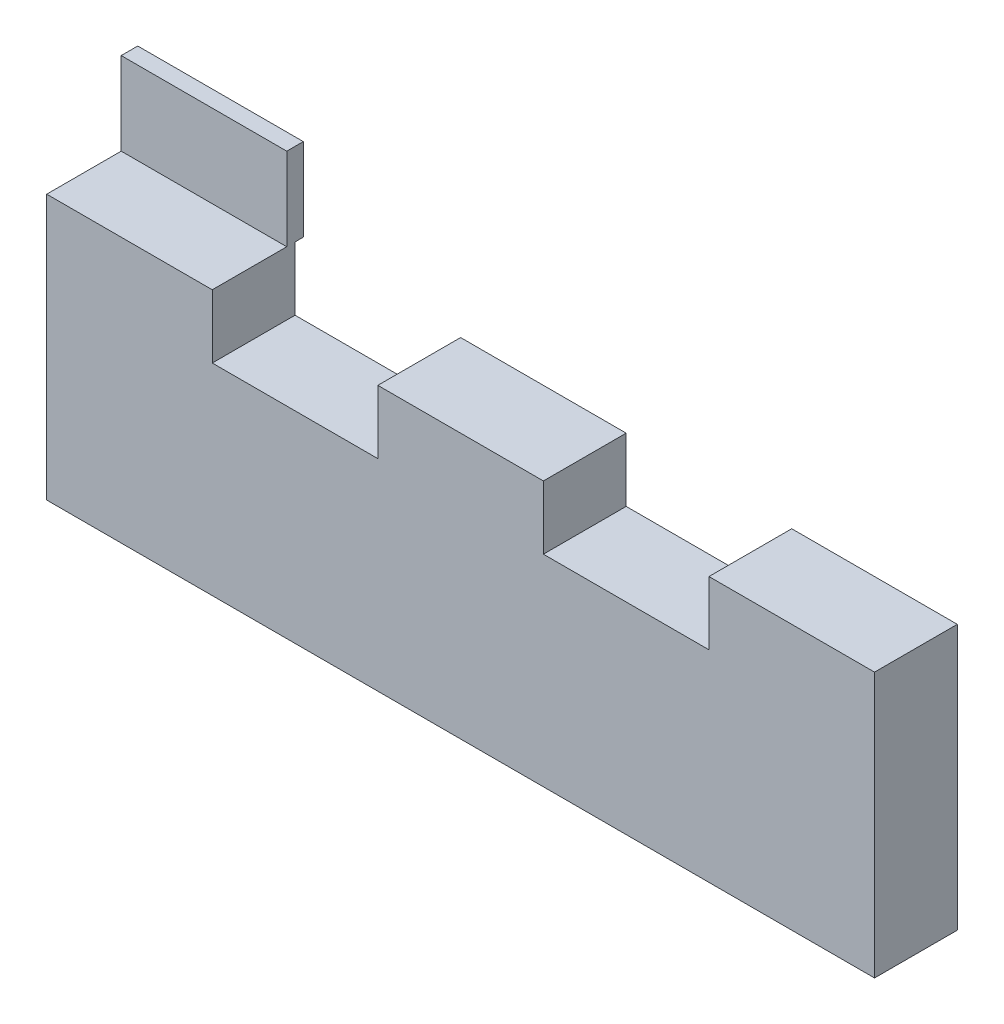
ISO-10303-21;
HEADER;
FILE_DESCRIPTION(('STEP AP214'),'2;1');
FILE_NAME('part.step','',(''),(''),'','','');
FILE_SCHEMA(('AUTOMOTIVE_DESIGN { 1 0 10303 214 1 1 1 1 }'));
ENDSEC;
DATA;
#1=APPLICATION_CONTEXT('core data for automotive mechanical design processes');
#2=APPLICATION_PROTOCOL_DEFINITION('international standard','automotive_design',2000,#1);
#3=PRODUCT_CONTEXT('',#1,'mechanical');
#4=PRODUCT('Part','Part','',(#3));
#5=PRODUCT_RELATED_PRODUCT_CATEGORY('part','',(#4));
#6=PRODUCT_DEFINITION_FORMATION('','',#4);
#7=PRODUCT_DEFINITION_CONTEXT('part definition',#1,'design');
#8=PRODUCT_DEFINITION('design','',#6,#7);
#9=PRODUCT_DEFINITION_SHAPE('','',#8);
#10=(LENGTH_UNIT() NAMED_UNIT(*) SI_UNIT(.MILLI.,.METRE.));
#11=(NAMED_UNIT(*) PLANE_ANGLE_UNIT() SI_UNIT($,.RADIAN.));
#12=(NAMED_UNIT(*) SI_UNIT($,.STERADIAN.) SOLID_ANGLE_UNIT());
#13=UNCERTAINTY_MEASURE_WITH_UNIT(LENGTH_MEASURE(1.E-05),#10,'distance_accuracy_value','');
#14=(GEOMETRIC_REPRESENTATION_CONTEXT(3) GLOBAL_UNCERTAINTY_ASSIGNED_CONTEXT((#13)) GLOBAL_UNIT_ASSIGNED_CONTEXT((#10,
#11,#12)) REPRESENTATION_CONTEXT('',''));
#15=CARTESIAN_POINT('',(0.,0.,0.));
#16=DIRECTION('',(0.,0.,1.));
#17=DIRECTION('',(1.,0.,0.));
#18=AXIS2_PLACEMENT_3D('',#15,#16,#17);
#19=CARTESIAN_POINT('',(0.,32.,10.));
#20=DIRECTION('',(0.,-1.,0.));
#21=DIRECTION('',(0.,0.,-1.));
#22=AXIS2_PLACEMENT_3D('',#19,#20,#21);
#23=PLANE('',#22);
#24=DIRECTION('',(1.,0.,0.));
#25=VECTOR('',#24,1.);
#26=CARTESIAN_POINT('',(0.,32.,1.));
#27=LINE('',#26,#25);
#28=CARTESIAN_POINT('',(0.,32.,1.));
#29=VERTEX_POINT('',#28);
#30=CARTESIAN_POINT('',(20.,32.,1.));
#31=VERTEX_POINT('',#30);
#32=EDGE_CURVE('E52',#29,#31,#27,.T.);
#33=ORIENTED_EDGE('',*,*,#32,.F.);
#34=DIRECTION('',(0.,0.,-1.));
#35=VECTOR('',#34,1.);
#36=CARTESIAN_POINT('',(0.,32.,10.));
#37=LINE('',#36,#35);
#38=CARTESIAN_POINT('',(0.,32.,10.));
#39=VERTEX_POINT('',#38);
#40=EDGE_CURVE('E169',#39,#29,#37,.T.);
#41=ORIENTED_EDGE('',*,*,#40,.F.);
#42=DIRECTION('',(-1.,0.,0.));
#43=VECTOR('',#42,1.);
#44=CARTESIAN_POINT('',(0.,32.,10.));
#45=LINE('',#44,#43);
#46=CARTESIAN_POINT('',(20.,32.,10.));
#47=VERTEX_POINT('',#46);
#48=EDGE_CURVE('E201',#47,#39,#45,.T.);
#49=ORIENTED_EDGE('',*,*,#48,.F.);
#50=DIRECTION('',(0.,0.,-1.));
#51=VECTOR('',#50,1.);
#52=CARTESIAN_POINT('',(20.,32.,10.));
#53=LINE('',#52,#51);
#54=EDGE_CURVE('E48',#47,#31,#53,.T.);
#55=ORIENTED_EDGE('',*,*,#54,.T.);
#56=EDGE_LOOP('',(#33,#41,#49,#55));
#57=FACE_BOUND('',#56,.T.);
#58=ADVANCED_FACE('F33',(#57),#23,.F.);
#59=CARTESIAN_POINT('',(100.,0.,10.));
#60=DIRECTION('',(0.,1.,0.));
#61=DIRECTION('',(-1.,0.,0.));
#62=AXIS2_PLACEMENT_3D('',#59,#60,#61);
#63=PLANE('',#62);
#64=DIRECTION('',(1.,0.,0.));
#65=VECTOR('',#64,1.);
#66=CARTESIAN_POINT('',(100.,0.,0.));
#67=LINE('',#66,#65);
#68=CARTESIAN_POINT('',(0.,0.,0.));
#69=VERTEX_POINT('',#68);
#70=CARTESIAN_POINT('',(100.,0.,0.));
#71=VERTEX_POINT('',#70);
#72=EDGE_CURVE('E170',#69,#71,#67,.T.);
#73=ORIENTED_EDGE('',*,*,#72,.T.);
#74=DIRECTION('',(0.,0.,-1.));
#75=VECTOR('',#74,1.);
#76=CARTESIAN_POINT('',(100.,0.,10.));
#77=LINE('',#76,#75);
#78=CARTESIAN_POINT('',(100.,0.,10.));
#79=VERTEX_POINT('',#78);
#80=EDGE_CURVE('E11',#79,#71,#77,.T.);
#81=ORIENTED_EDGE('',*,*,#80,.F.);
#82=DIRECTION('',(1.,0.,0.));
#83=VECTOR('',#82,1.);
#84=CARTESIAN_POINT('',(100.,0.,10.));
#85=LINE('',#84,#83);
#86=CARTESIAN_POINT('',(0.,0.,10.));
#87=VERTEX_POINT('',#86);
#88=EDGE_CURVE('E179',#87,#79,#85,.T.);
#89=ORIENTED_EDGE('',*,*,#88,.F.);
#90=DIRECTION('',(0.,0.,-1.));
#91=VECTOR('',#90,1.);
#92=CARTESIAN_POINT('',(0.,0.,10.));
#93=LINE('',#92,#91);
#94=EDGE_CURVE('E204',#87,#69,#93,.T.);
#95=ORIENTED_EDGE('',*,*,#94,.T.);
#96=EDGE_LOOP('',(#73,#81,#89,#95));
#97=FACE_BOUND('',#96,.T.);
#98=ADVANCED_FACE('F35',(#97),#63,.F.);
#99=CARTESIAN_POINT('',(100.,32.,10.));
#100=DIRECTION('',(-1.,0.,0.));
#101=DIRECTION('',(0.,0.,1.));
#102=AXIS2_PLACEMENT_3D('',#99,#100,#101);
#103=PLANE('',#102);
#104=DIRECTION('',(0.,1.,0.));
#105=VECTOR('',#104,1.);
#106=CARTESIAN_POINT('',(100.,32.,0.));
#107=LINE('',#106,#105);
#108=CARTESIAN_POINT('',(100.,32.,0.));
#109=VERTEX_POINT('',#108);
#110=EDGE_CURVE('E173',#71,#109,#107,.T.);
#111=ORIENTED_EDGE('',*,*,#110,.T.);
#112=DIRECTION('',(0.,0.,-1.));
#113=VECTOR('',#112,1.);
#114=CARTESIAN_POINT('',(100.,32.,10.));
#115=LINE('',#114,#113);
#116=CARTESIAN_POINT('',(100.,32.,10.));
#117=VERTEX_POINT('',#116);
#118=EDGE_CURVE('E41',#117,#109,#115,.T.);
#119=ORIENTED_EDGE('',*,*,#118,.F.);
#120=DIRECTION('',(0.,1.,0.));
#121=VECTOR('',#120,1.);
#122=CARTESIAN_POINT('',(100.,32.,10.));
#123=LINE('',#122,#121);
#124=EDGE_CURVE('E182',#79,#117,#123,.T.);
#125=ORIENTED_EDGE('',*,*,#124,.F.);
#126=ORIENTED_EDGE('',*,*,#80,.T.);
#127=EDGE_LOOP('',(#111,#119,#125,#126));
#128=FACE_BOUND('',#127,.T.);
#129=ADVANCED_FACE('F279',(#128),#103,.F.);
#130=CARTESIAN_POINT('',(80.,32.,10.));
#131=DIRECTION('',(0.,-1.,0.));
#132=DIRECTION('',(1.,0.,0.));
#133=AXIS2_PLACEMENT_3D('',#130,#131,#132);
#134=PLANE('',#133);
#135=DIRECTION('',(-1.,0.,0.));
#136=VECTOR('',#135,1.);
#137=CARTESIAN_POINT('',(80.,32.,0.));
#138=LINE('',#137,#136);
#139=CARTESIAN_POINT('',(80.,32.,0.));
#140=VERTEX_POINT('',#139);
#141=EDGE_CURVE('E207',#109,#140,#138,.T.);
#142=ORIENTED_EDGE('',*,*,#141,.T.);
#143=DIRECTION('',(0.,0.,-1.));
#144=VECTOR('',#143,1.);
#145=CARTESIAN_POINT('',(80.,32.,10.));
#146=LINE('',#145,#144);
#147=CARTESIAN_POINT('',(80.,32.,10.));
#148=VERTEX_POINT('',#147);
#149=EDGE_CURVE('E249',#148,#140,#146,.T.);
#150=ORIENTED_EDGE('',*,*,#149,.F.);
#151=DIRECTION('',(-1.,0.,0.));
#152=VECTOR('',#151,1.);
#153=CARTESIAN_POINT('',(80.,32.,10.));
#154=LINE('',#153,#152);
#155=EDGE_CURVE('E185',#117,#148,#154,.T.);
#156=ORIENTED_EDGE('',*,*,#155,.F.);
#157=ORIENTED_EDGE('',*,*,#118,.T.);
#158=EDGE_LOOP('',(#142,#150,#156,#157));
#159=FACE_BOUND('',#158,.T.);
#160=ADVANCED_FACE('F256',(#159),#134,.F.);
#161=CARTESIAN_POINT('',(80.,24.3353293413174,10.));
#162=DIRECTION('',(1.,0.,0.));
#163=DIRECTION('',(0.,0.,-1.));
#164=AXIS2_PLACEMENT_3D('',#161,#162,#163);
#165=PLANE('',#164);
#166=DIRECTION('',(0.,-1.,0.));
#167=VECTOR('',#166,1.);
#168=CARTESIAN_POINT('',(80.,24.3353293413174,0.));
#169=LINE('',#168,#167);
#170=CARTESIAN_POINT('',(80.,24.3353293413174,0.));
#171=VERTEX_POINT('',#170);
#172=EDGE_CURVE('E209',#140,#171,#169,.T.);
#173=ORIENTED_EDGE('',*,*,#172,.T.);
#174=DIRECTION('',(0.,0.,-1.));
#175=VECTOR('',#174,1.);
#176=CARTESIAN_POINT('',(80.,24.3353293413174,10.));
#177=LINE('',#176,#175);
#178=CARTESIAN_POINT('',(80.,24.3353293413174,10.));
#179=VERTEX_POINT('',#178);
#180=EDGE_CURVE('E246',#179,#171,#177,.T.);
#181=ORIENTED_EDGE('',*,*,#180,.F.);
#182=DIRECTION('',(0.,-1.,0.));
#183=VECTOR('',#182,1.);
#184=CARTESIAN_POINT('',(80.,24.3353293413174,10.));
#185=LINE('',#184,#183);
#186=EDGE_CURVE('E187',#148,#179,#185,.T.);
#187=ORIENTED_EDGE('',*,*,#186,.F.);
#188=ORIENTED_EDGE('',*,*,#149,.T.);
#189=EDGE_LOOP('',(#173,#181,#187,#188));
#190=FACE_BOUND('',#189,.T.);
#191=ADVANCED_FACE('F267',(#190),#165,.F.);
#192=CARTESIAN_POINT('',(60.,24.3353293413174,10.));
#193=DIRECTION('',(0.,-1.,0.));
#194=DIRECTION('',(0.,0.,-1.));
#195=AXIS2_PLACEMENT_3D('',#192,#193,#194);
#196=PLANE('',#195);
#197=DIRECTION('',(-1.,0.,0.));
#198=VECTOR('',#197,1.);
#199=CARTESIAN_POINT('',(60.,24.3353293413174,0.));
#200=LINE('',#199,#198);
#201=CARTESIAN_POINT('',(60.,24.3353293413174,0.));
#202=VERTEX_POINT('',#201);
#203=EDGE_CURVE('E211',#171,#202,#200,.T.);
#204=ORIENTED_EDGE('',*,*,#203,.T.);
#205=DIRECTION('',(0.,0.,-1.));
#206=VECTOR('',#205,1.);
#207=CARTESIAN_POINT('',(60.,24.3353293413174,10.));
#208=LINE('',#207,#206);
#209=CARTESIAN_POINT('',(60.,24.3353293413174,10.));
#210=VERTEX_POINT('',#209);
#211=EDGE_CURVE('E243',#210,#202,#208,.T.);
#212=ORIENTED_EDGE('',*,*,#211,.F.);
#213=DIRECTION('',(-1.,0.,0.));
#214=VECTOR('',#213,1.);
#215=CARTESIAN_POINT('',(60.,24.3353293413174,10.));
#216=LINE('',#215,#214);
#217=EDGE_CURVE('E189',#179,#210,#216,.T.);
#218=ORIENTED_EDGE('',*,*,#217,.F.);
#219=ORIENTED_EDGE('',*,*,#180,.T.);
#220=EDGE_LOOP('',(#204,#212,#218,#219));
#221=FACE_BOUND('',#220,.T.);
#222=ADVANCED_FACE('F271',(#221),#196,.F.);
#223=CARTESIAN_POINT('',(60.,32.,10.));
#224=DIRECTION('',(-1.,0.,0.));
#225=DIRECTION('',(0.,-1.,0.));
#226=AXIS2_PLACEMENT_3D('',#223,#224,#225);
#227=PLANE('',#226);
#228=DIRECTION('',(0.,1.,0.));
#229=VECTOR('',#228,1.);
#230=CARTESIAN_POINT('',(60.,32.,0.));
#231=LINE('',#230,#229);
#232=CARTESIAN_POINT('',(60.,32.,0.));
#233=VERTEX_POINT('',#232);
#234=EDGE_CURVE('E213',#202,#233,#231,.T.);
#235=ORIENTED_EDGE('',*,*,#234,.T.);
#236=DIRECTION('',(0.,0.,-1.));
#237=VECTOR('',#236,1.);
#238=CARTESIAN_POINT('',(60.,32.,10.));
#239=LINE('',#238,#237);
#240=CARTESIAN_POINT('',(60.,32.,10.));
#241=VERTEX_POINT('',#240);
#242=EDGE_CURVE('E240',#241,#233,#239,.T.);
#243=ORIENTED_EDGE('',*,*,#242,.F.);
#244=DIRECTION('',(0.,1.,0.));
#245=VECTOR('',#244,1.);
#246=CARTESIAN_POINT('',(60.,32.,10.));
#247=LINE('',#246,#245);
#248=EDGE_CURVE('E191',#210,#241,#247,.T.);
#249=ORIENTED_EDGE('',*,*,#248,.F.);
#250=ORIENTED_EDGE('',*,*,#211,.T.);
#251=EDGE_LOOP('',(#235,#243,#249,#250));
#252=FACE_BOUND('',#251,.T.);
#253=ADVANCED_FACE('F323',(#252),#227,.F.);
#254=CARTESIAN_POINT('',(40.,32.,10.));
#255=DIRECTION('',(0.,-1.,0.));
#256=DIRECTION('',(0.,0.,-1.));
#257=AXIS2_PLACEMENT_3D('',#254,#255,#256);
#258=PLANE('',#257);
#259=DIRECTION('',(-1.,0.,0.));
#260=VECTOR('',#259,1.);
#261=CARTESIAN_POINT('',(40.,32.,0.));
#262=LINE('',#261,#260);
#263=CARTESIAN_POINT('',(40.,32.,0.));
#264=VERTEX_POINT('',#263);
#265=EDGE_CURVE('E215',#233,#264,#262,.T.);
#266=ORIENTED_EDGE('',*,*,#265,.T.);
#267=DIRECTION('',(0.,0.,-1.));
#268=VECTOR('',#267,1.);
#269=CARTESIAN_POINT('',(40.,32.,10.));
#270=LINE('',#269,#268);
#271=CARTESIAN_POINT('',(40.,32.,10.));
#272=VERTEX_POINT('',#271);
#273=EDGE_CURVE('E237',#272,#264,#270,.T.);
#274=ORIENTED_EDGE('',*,*,#273,.F.);
#275=DIRECTION('',(-1.,0.,0.));
#276=VECTOR('',#275,1.);
#277=CARTESIAN_POINT('',(40.,32.,10.));
#278=LINE('',#277,#276);
#279=EDGE_CURVE('E193',#241,#272,#278,.T.);
#280=ORIENTED_EDGE('',*,*,#279,.F.);
#281=ORIENTED_EDGE('',*,*,#242,.T.);
#282=EDGE_LOOP('',(#266,#274,#280,#281));
#283=FACE_BOUND('',#282,.T.);
#284=ADVANCED_FACE('F321',(#283),#258,.F.);
#285=CARTESIAN_POINT('',(40.,24.3353293413174,10.));
#286=DIRECTION('',(1.,0.,0.));
#287=DIRECTION('',(0.,0.,-1.));
#288=AXIS2_PLACEMENT_3D('',#285,#286,#287);
#289=PLANE('',#288);
#290=DIRECTION('',(0.,-1.,0.));
#291=VECTOR('',#290,1.);
#292=CARTESIAN_POINT('',(40.,24.3353293413174,0.));
#293=LINE('',#292,#291);
#294=CARTESIAN_POINT('',(40.,24.3353293413174,0.));
#295=VERTEX_POINT('',#294);
#296=EDGE_CURVE('E217',#264,#295,#293,.T.);
#297=ORIENTED_EDGE('',*,*,#296,.T.);
#298=DIRECTION('',(0.,0.,-1.));
#299=VECTOR('',#298,1.);
#300=CARTESIAN_POINT('',(40.,24.3353293413174,10.));
#301=LINE('',#300,#299);
#302=CARTESIAN_POINT('',(40.,24.3353293413174,10.));
#303=VERTEX_POINT('',#302);
#304=EDGE_CURVE('E234',#303,#295,#301,.T.);
#305=ORIENTED_EDGE('',*,*,#304,.F.);
#306=DIRECTION('',(0.,-1.,0.));
#307=VECTOR('',#306,1.);
#308=CARTESIAN_POINT('',(40.,24.3353293413174,10.));
#309=LINE('',#308,#307);
#310=EDGE_CURVE('E195',#272,#303,#309,.T.);
#311=ORIENTED_EDGE('',*,*,#310,.F.);
#312=ORIENTED_EDGE('',*,*,#273,.T.);
#313=EDGE_LOOP('',(#297,#305,#311,#312));
#314=FACE_BOUND('',#313,.T.);
#315=ADVANCED_FACE('F317',(#314),#289,.F.);
#316=CARTESIAN_POINT('',(20.,24.3353293413174,10.));
#317=DIRECTION('',(0.,-1.,0.));
#318=DIRECTION('',(0.,0.,-1.));
#319=AXIS2_PLACEMENT_3D('',#316,#317,#318);
#320=PLANE('',#319);
#321=DIRECTION('',(-1.,0.,0.));
#322=VECTOR('',#321,1.);
#323=CARTESIAN_POINT('',(20.,24.3353293413174,0.));
#324=LINE('',#323,#322);
#325=CARTESIAN_POINT('',(20.,24.3353293413174,0.));
#326=VERTEX_POINT('',#325);
#327=EDGE_CURVE('E219',#295,#326,#324,.T.);
#328=ORIENTED_EDGE('',*,*,#327,.T.);
#329=DIRECTION('',(0.,0.,-1.));
#330=VECTOR('',#329,1.);
#331=CARTESIAN_POINT('',(20.,24.3353293413174,10.));
#332=LINE('',#331,#330);
#333=CARTESIAN_POINT('',(20.,24.3353293413174,10.));
#334=VERTEX_POINT('',#333);
#335=EDGE_CURVE('E231',#334,#326,#332,.T.);
#336=ORIENTED_EDGE('',*,*,#335,.F.);
#337=DIRECTION('',(-1.,0.,0.));
#338=VECTOR('',#337,1.);
#339=CARTESIAN_POINT('',(20.,24.3353293413174,10.));
#340=LINE('',#339,#338);
#341=EDGE_CURVE('E197',#303,#334,#340,.T.);
#342=ORIENTED_EDGE('',*,*,#341,.F.);
#343=ORIENTED_EDGE('',*,*,#304,.T.);
#344=EDGE_LOOP('',(#328,#336,#342,#343));
#345=FACE_BOUND('',#344,.T.);
#346=ADVANCED_FACE('F312',(#345),#320,.F.);
#347=CARTESIAN_POINT('',(20.,32.,10.));
#348=DIRECTION('',(-1.,0.,0.));
#349=DIRECTION('',(0.,0.,1.));
#350=AXIS2_PLACEMENT_3D('',#347,#348,#349);
#351=PLANE('',#350);
#352=DIRECTION('',(0.,1.,0.));
#353=VECTOR('',#352,1.);
#354=CARTESIAN_POINT('',(20.,32.,0.));
#355=LINE('',#354,#353);
#356=CARTESIAN_POINT('',(20.,32.,0.));
#357=VERTEX_POINT('',#356);
#358=EDGE_CURVE('E221',#326,#357,#355,.T.);
#359=ORIENTED_EDGE('',*,*,#358,.T.);
#360=DIRECTION('',(0.,0.,-1.));
#361=VECTOR('',#360,1.);
#362=CARTESIAN_POINT('',(20.,32.,1.));
#363=LINE('',#362,#361);
#364=CARTESIAN_POINT('',(20.,32.,-1.));
#365=VERTEX_POINT('',#364);
#366=EDGE_CURVE('E291',#357,#365,#363,.T.);
#367=ORIENTED_EDGE('',*,*,#366,.T.);
#368=DIRECTION('',(0.,-1.,0.));
#369=VECTOR('',#368,1.);
#370=CARTESIAN_POINT('',(20.,42.,-1.));
#371=LINE('',#370,#369);
#372=CARTESIAN_POINT('',(20.,42.,-1.));
#373=VERTEX_POINT('',#372);
#374=EDGE_CURVE('E175',#373,#365,#371,.T.);
#375=ORIENTED_EDGE('',*,*,#374,.F.);
#376=DIRECTION('',(0.,0.,-1.));
#377=VECTOR('',#376,1.);
#378=CARTESIAN_POINT('',(20.,42.,1.));
#379=LINE('',#378,#377);
#380=CARTESIAN_POINT('',(20.,42.,1.));
#381=VERTEX_POINT('',#380);
#382=EDGE_CURVE('E155',#381,#373,#379,.T.);
#383=ORIENTED_EDGE('',*,*,#382,.F.);
#384=DIRECTION('',(0.,-1.,0.));
#385=VECTOR('',#384,1.);
#386=CARTESIAN_POINT('',(20.,42.,1.));
#387=LINE('',#386,#385);
#388=EDGE_CURVE('E152',#381,#31,#387,.T.);
#389=ORIENTED_EDGE('',*,*,#388,.T.);
#390=ORIENTED_EDGE('',*,*,#54,.F.);
#391=DIRECTION('',(0.,1.,0.));
#392=VECTOR('',#391,1.);
#393=CARTESIAN_POINT('',(20.,32.,10.));
#394=LINE('',#393,#392);
#395=EDGE_CURVE('E199',#334,#47,#394,.T.);
#396=ORIENTED_EDGE('',*,*,#395,.F.);
#397=ORIENTED_EDGE('',*,*,#335,.T.);
#398=EDGE_LOOP('',(#359,#367,#375,#383,#389,#390,#396,#397));
#399=FACE_BOUND('',#398,.T.);
#400=ADVANCED_FACE('F305',(#399),#351,.F.);
#401=CARTESIAN_POINT('',(0.,0.,10.));
#402=DIRECTION('',(1.,0.,0.));
#403=DIRECTION('',(0.,0.,-1.));
#404=AXIS2_PLACEMENT_3D('',#401,#402,#403);
#405=PLANE('',#404);
#406=DIRECTION('',(0.,-1.,0.));
#407=VECTOR('',#406,1.);
#408=CARTESIAN_POINT('',(0.,0.,0.));
#409=LINE('',#408,#407);
#410=CARTESIAN_POINT('',(0.,32.,0.));
#411=VERTEX_POINT('',#410);
#412=EDGE_CURVE('E183',#411,#69,#409,.T.);
#413=ORIENTED_EDGE('',*,*,#412,.T.);
#414=ORIENTED_EDGE('',*,*,#94,.F.);
#415=DIRECTION('',(0.,-1.,0.));
#416=VECTOR('',#415,1.);
#417=CARTESIAN_POINT('',(0.,0.,10.));
#418=LINE('',#417,#416);
#419=EDGE_CURVE('E203',#39,#87,#418,.T.);
#420=ORIENTED_EDGE('',*,*,#419,.F.);
#421=ORIENTED_EDGE('',*,*,#40,.T.);
#422=DIRECTION('',(0.,-1.,0.));
#423=VECTOR('',#422,1.);
#424=CARTESIAN_POINT('',(0.,42.,1.));
#425=LINE('',#424,#423);
#426=CARTESIAN_POINT('',(0.,42.,1.));
#427=VERTEX_POINT('',#426);
#428=EDGE_CURVE('E150',#427,#29,#425,.T.);
#429=ORIENTED_EDGE('',*,*,#428,.F.);
#430=DIRECTION('',(0.,0.,1.));
#431=VECTOR('',#430,1.);
#432=CARTESIAN_POINT('',(0.,42.,1.));
#433=LINE('',#432,#431);
#434=CARTESIAN_POINT('',(0.,42.,-1.));
#435=VERTEX_POINT('',#434);
#436=EDGE_CURVE('E156',#435,#427,#433,.T.);
#437=ORIENTED_EDGE('',*,*,#436,.F.);
#438=DIRECTION('',(0.,-1.,0.));
#439=VECTOR('',#438,1.);
#440=CARTESIAN_POINT('',(0.,42.,-1.));
#441=LINE('',#440,#439);
#442=CARTESIAN_POINT('',(0.,32.,-1.));
#443=VERTEX_POINT('',#442);
#444=EDGE_CURVE('E292',#435,#443,#441,.T.);
#445=ORIENTED_EDGE('',*,*,#444,.T.);
#446=DIRECTION('',(0.,0.,1.));
#447=VECTOR('',#446,1.);
#448=CARTESIAN_POINT('',(0.,32.,1.));
#449=LINE('',#448,#447);
#450=EDGE_CURVE('E290',#443,#411,#449,.T.);
#451=ORIENTED_EDGE('',*,*,#450,.T.);
#452=EDGE_LOOP('',(#413,#414,#420,#421,#429,#437,#445,#451));
#453=FACE_BOUND('',#452,.T.);
#454=ADVANCED_FACE('F167',(#453),#405,.F.);
#455=CARTESIAN_POINT('',(0.,0.,10.));
#456=DIRECTION('',(0.,0.,-1.));
#457=DIRECTION('',(-1.,0.,0.));
#458=AXIS2_PLACEMENT_3D('',#455,#456,#457);
#459=PLANE('',#458);
#460=ORIENTED_EDGE('',*,*,#88,.T.);
#461=ORIENTED_EDGE('',*,*,#124,.T.);
#462=ORIENTED_EDGE('',*,*,#155,.T.);
#463=ORIENTED_EDGE('',*,*,#186,.T.);
#464=ORIENTED_EDGE('',*,*,#217,.T.);
#465=ORIENTED_EDGE('',*,*,#248,.T.);
#466=ORIENTED_EDGE('',*,*,#279,.T.);
#467=ORIENTED_EDGE('',*,*,#310,.T.);
#468=ORIENTED_EDGE('',*,*,#341,.T.);
#469=ORIENTED_EDGE('',*,*,#395,.T.);
#470=ORIENTED_EDGE('',*,*,#48,.T.);
#471=ORIENTED_EDGE('',*,*,#419,.T.);
#472=EDGE_LOOP('',(#460,#461,#462,#463,#464,#465,#466,#467,#468,#469,#470,#471));
#473=FACE_BOUND('',#472,.T.);
#474=ADVANCED_FACE('F275',(#473),#459,.F.);
#475=CARTESIAN_POINT('',(0.,0.,0.));
#476=DIRECTION('',(0.,0.,-1.));
#477=DIRECTION('',(-1.,0.,0.));
#478=AXIS2_PLACEMENT_3D('',#475,#476,#477);
#479=PLANE('',#478);
#480=ORIENTED_EDGE('',*,*,#72,.F.);
#481=ORIENTED_EDGE('',*,*,#412,.F.);
#482=DIRECTION('',(-1.,0.,0.));
#483=VECTOR('',#482,1.);
#484=CARTESIAN_POINT('',(0.,32.,0.));
#485=LINE('',#484,#483);
#486=EDGE_CURVE('E223',#357,#411,#485,.T.);
#487=ORIENTED_EDGE('',*,*,#486,.F.);
#488=ORIENTED_EDGE('',*,*,#358,.F.);
#489=ORIENTED_EDGE('',*,*,#327,.F.);
#490=ORIENTED_EDGE('',*,*,#296,.F.);
#491=ORIENTED_EDGE('',*,*,#265,.F.);
#492=ORIENTED_EDGE('',*,*,#234,.F.);
#493=ORIENTED_EDGE('',*,*,#203,.F.);
#494=ORIENTED_EDGE('',*,*,#172,.F.);
#495=ORIENTED_EDGE('',*,*,#141,.F.);
#496=ORIENTED_EDGE('',*,*,#110,.F.);
#497=EDGE_LOOP('',(#480,#481,#487,#488,#489,#490,#491,#492,#493,#494,#495,#496));
#498=FACE_BOUND('',#497,.T.);
#499=ADVANCED_FACE('F262',(#498),#479,.T.);
#500=CARTESIAN_POINT('',(0.,42.,1.));
#501=DIRECTION('',(0.,0.,-1.));
#502=DIRECTION('',(-1.,0.,0.));
#503=AXIS2_PLACEMENT_3D('',#500,#501,#502);
#504=PLANE('',#503);
#505=ORIENTED_EDGE('',*,*,#32,.T.);
#506=ORIENTED_EDGE('',*,*,#388,.F.);
#507=DIRECTION('',(1.,0.,0.));
#508=VECTOR('',#507,1.);
#509=CARTESIAN_POINT('',(0.,42.,1.));
#510=LINE('',#509,#508);
#511=EDGE_CURVE('E146',#427,#381,#510,.T.);
#512=ORIENTED_EDGE('',*,*,#511,.F.);
#513=ORIENTED_EDGE('',*,*,#428,.T.);
#514=EDGE_LOOP('',(#505,#506,#512,#513));
#515=FACE_BOUND('',#514,.T.);
#516=ADVANCED_FACE('F148',(#515),#504,.F.);
#517=CARTESIAN_POINT('',(0.,42.,-1.));
#518=DIRECTION('',(0.,0.,1.));
#519=DIRECTION('',(1.,0.,0.));
#520=AXIS2_PLACEMENT_3D('',#517,#518,#519);
#521=PLANE('',#520);
#522=DIRECTION('',(-1.,0.,0.));
#523=VECTOR('',#522,1.);
#524=CARTESIAN_POINT('',(0.,32.,-1.));
#525=LINE('',#524,#523);
#526=EDGE_CURVE('E165',#365,#443,#525,.T.);
#527=ORIENTED_EDGE('',*,*,#526,.T.);
#528=ORIENTED_EDGE('',*,*,#444,.F.);
#529=DIRECTION('',(-1.,0.,0.));
#530=VECTOR('',#529,1.);
#531=CARTESIAN_POINT('',(0.,42.,-1.));
#532=LINE('',#531,#530);
#533=EDGE_CURVE('E161',#373,#435,#532,.T.);
#534=ORIENTED_EDGE('',*,*,#533,.F.);
#535=ORIENTED_EDGE('',*,*,#374,.T.);
#536=EDGE_LOOP('',(#527,#528,#534,#535));
#537=FACE_BOUND('',#536,.T.);
#538=ADVANCED_FACE('F303',(#537),#521,.F.);
#539=CARTESIAN_POINT('',(0.,42.,0.));
#540=DIRECTION('',(0.,-1.,0.));
#541=DIRECTION('',(0.,0.,-1.));
#542=AXIS2_PLACEMENT_3D('',#539,#540,#541);
#543=PLANE('',#542);
#544=ORIENTED_EDGE('',*,*,#436,.T.);
#545=ORIENTED_EDGE('',*,*,#511,.T.);
#546=ORIENTED_EDGE('',*,*,#382,.T.);
#547=ORIENTED_EDGE('',*,*,#533,.T.);
#548=EDGE_LOOP('',(#544,#545,#546,#547));
#549=FACE_BOUND('',#548,.T.);
#550=ADVANCED_FACE('F159',(#549),#543,.F.);
#551=CARTESIAN_POINT('',(0.,32.,0.));
#552=DIRECTION('',(0.,-1.,0.));
#553=DIRECTION('',(0.,0.,-1.));
#554=AXIS2_PLACEMENT_3D('',#551,#552,#553);
#555=PLANE('',#554);
#556=ORIENTED_EDGE('',*,*,#366,.F.);
#557=ORIENTED_EDGE('',*,*,#486,.T.);
#558=ORIENTED_EDGE('',*,*,#450,.F.);
#559=ORIENTED_EDGE('',*,*,#526,.F.);
#560=EDGE_LOOP('',(#556,#557,#558,#559));
#561=FACE_BOUND('',#560,.T.);
#562=ADVANCED_FACE('F288',(#561),#555,.T.);
#563=CLOSED_SHELL('',(#58,#98,#129,#160,#191,#222,#253,#284,#315,#346,#400,#454,#474,#499,#516,
#538,#550,#562));
#564=MANIFOLD_SOLID_BREP('B2',#563);
#565=ADVANCED_BREP_SHAPE_REPRESENTATION('',(#18,#564),#14);
#566=SHAPE_DEFINITION_REPRESENTATION(#9,#565);
ENDSEC;
END-ISO-10303-21;
